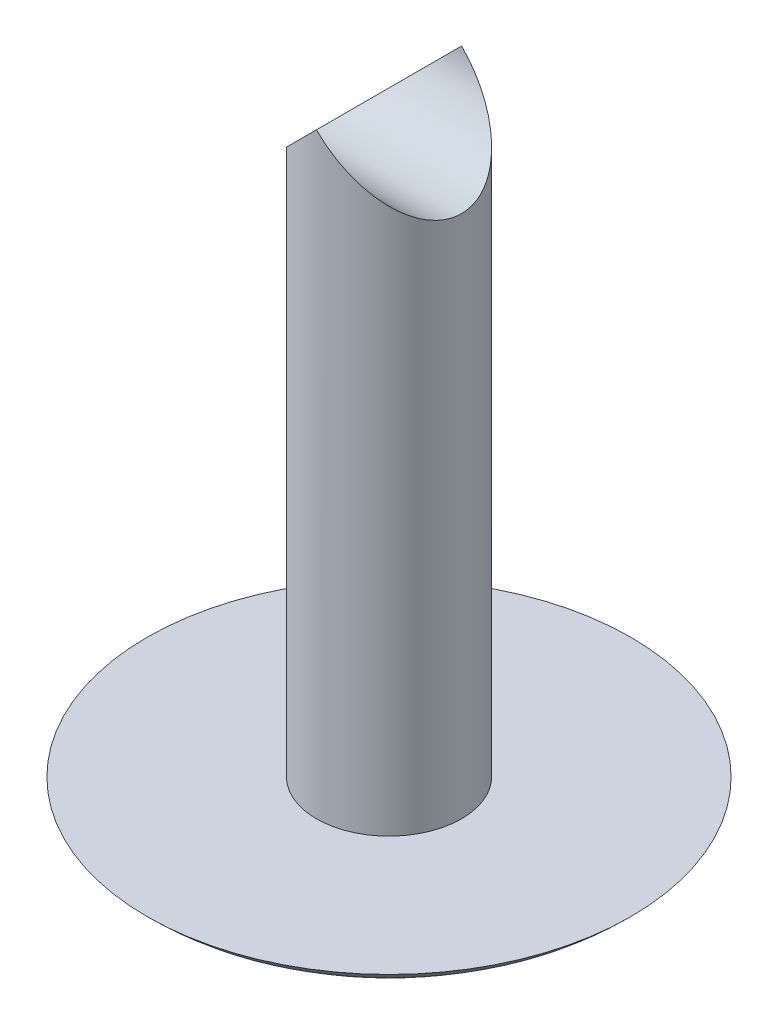
ISO-10303-21;
HEADER;
FILE_DESCRIPTION(('STEP AP214'),'2;1');
FILE_NAME('part.step','',(''),(''),'','','');
FILE_SCHEMA(('AUTOMOTIVE_DESIGN { 1 0 10303 214 1 1 1 1 }'));
ENDSEC;
DATA;
#1=APPLICATION_CONTEXT('core data for automotive mechanical design processes');
#2=APPLICATION_PROTOCOL_DEFINITION('international standard','automotive_design',2000,#1);
#3=PRODUCT_CONTEXT('',#1,'mechanical');
#4=PRODUCT('Part','Part','',(#3));
#5=PRODUCT_RELATED_PRODUCT_CATEGORY('part','',(#4));
#6=PRODUCT_DEFINITION_FORMATION('','',#4);
#7=PRODUCT_DEFINITION_CONTEXT('part definition',#1,'design');
#8=PRODUCT_DEFINITION('design','',#6,#7);
#9=PRODUCT_DEFINITION_SHAPE('','',#8);
#10=(LENGTH_UNIT() NAMED_UNIT(*) SI_UNIT(.MILLI.,.METRE.));
#11=(NAMED_UNIT(*) PLANE_ANGLE_UNIT() SI_UNIT($,.RADIAN.));
#12=(NAMED_UNIT(*) SI_UNIT($,.STERADIAN.) SOLID_ANGLE_UNIT());
#13=UNCERTAINTY_MEASURE_WITH_UNIT(LENGTH_MEASURE(1.E-05),#10,'distance_accuracy_value','');
#14=(GEOMETRIC_REPRESENTATION_CONTEXT(3) GLOBAL_UNCERTAINTY_ASSIGNED_CONTEXT((#13)) GLOBAL_UNIT_ASSIGNED_CONTEXT((#10,
#11,#12)) REPRESENTATION_CONTEXT('',''));
#15=CARTESIAN_POINT('',(0.,0.,0.));
#16=DIRECTION('',(0.,0.,1.));
#17=DIRECTION('',(1.,0.,0.));
#18=AXIS2_PLACEMENT_3D('',#15,#16,#17);
#19=CARTESIAN_POINT('',(0.,-37.,0.));
#20=DIRECTION('',(0.,1.,0.));
#21=DIRECTION('',(-1.,0.,0.));
#22=AXIS2_PLACEMENT_3D('',#19,#20,#21);
#23=CYLINDRICAL_SURFACE('',#22,4.5);
#24=CARTESIAN_POINT('',(0.,-37.,0.));
#25=DIRECTION('',(0.,-1.,0.));
#26=DIRECTION('',(1.,0.,0.));
#27=AXIS2_PLACEMENT_3D('',#24,#25,#26);
#28=CIRCLE('',#27,4.5);
#29=CARTESIAN_POINT('',(4.5,-37.,0.));
#30=VERTEX_POINT('',#29);
#31=EDGE_CURVE('E11',#30,#30,#28,.T.);
#32=ORIENTED_EDGE('',*,*,#31,.F.);
#33=EDGE_LOOP('',(#32));
#34=FACE_BOUND('',#33,.T.);
#35=CARTESIAN_POINT('',(0.,0.,0.));
#36=DIRECTION('',(-0.707106781186548,0.707106781186548,0.));
#37=DIRECTION('',(0.707106781186548,0.707106781186548,0.));
#38=AXIS2_PLACEMENT_3D('',#35,#36,#37);
#39=ELLIPSE('',#38,6.36396103067893,4.5);
#40=CARTESIAN_POINT('',(0.,0.,-4.5));
#41=VERTEX_POINT('',#40);
#42=CARTESIAN_POINT('',(0.,0.,4.5));
#43=VERTEX_POINT('',#42);
#44=EDGE_CURVE('E25',#41,#43,#39,.T.);
#45=ORIENTED_EDGE('',*,*,#44,.F.);
#46=CARTESIAN_POINT('',(0.,0.,0.));
#47=DIRECTION('',(0.707106781186548,0.707106781186548,0.));
#48=DIRECTION('',(-0.707106781186548,0.707106781186548,0.));
#49=AXIS2_PLACEMENT_3D('',#46,#47,#48);
#50=ELLIPSE('',#49,6.36396103067893,4.5);
#51=EDGE_CURVE('E37',#43,#41,#50,.T.);
#52=ORIENTED_EDGE('',*,*,#51,.F.);
#53=EDGE_LOOP('',(#45,#52));
#54=FACE_BOUND('',#53,.T.);
#55=ADVANCED_FACE('F17',(#34,#54),#23,.T.);
#56=CARTESIAN_POINT('',(30.,0.,0.));
#57=DIRECTION('',(-1.,0.,0.));
#58=DIRECTION('',(0.,-1.,0.));
#59=AXIS2_PLACEMENT_3D('',#56,#57,#58);
#60=CYLINDRICAL_SURFACE('',#59,4.5);
#61=ORIENTED_EDGE('',*,*,#44,.T.);
#62=ORIENTED_EDGE('',*,*,#51,.T.);
#63=EDGE_LOOP('',(#61,#62));
#64=FACE_BOUND('',#63,.T.);
#65=ADVANCED_FACE('F42',(#64),#60,.F.);
#66=CARTESIAN_POINT('',(0.,-40.,0.));
#67=DIRECTION('',(0.,-1.,0.));
#68=DIRECTION('',(1.,0.,0.));
#69=AXIS2_PLACEMENT_3D('',#66,#67,#68);
#70=PLANE('',#69);
#71=CARTESIAN_POINT('',(0.,-40.,0.));
#72=DIRECTION('',(0.,-1.,0.));
#73=DIRECTION('',(1.,0.,0.));
#74=AXIS2_PLACEMENT_3D('',#71,#72,#73);
#75=CIRCLE('',#74,7.85857157145715);
#76=CARTESIAN_POINT('',(7.85857157145715,-40.,0.));
#77=VERTEX_POINT('',#76);
#78=EDGE_CURVE('E40',#77,#77,#75,.T.);
#79=ORIENTED_EDGE('',*,*,#78,.T.);
#80=EDGE_LOOP('',(#79));
#81=FACE_BOUND('',#80,.T.);
#82=ADVANCED_FACE('F61',(#81),#70,.T.);
#83=CARTESIAN_POINT('',(0.,-37.,0.));
#84=DIRECTION('',(0.,-1.,0.));
#85=DIRECTION('',(1.,0.,0.));
#86=AXIS2_PLACEMENT_3D('',#83,#84,#85);
#87=PLANE('',#86);
#88=ORIENTED_EDGE('',*,*,#31,.T.);
#89=EDGE_LOOP('',(#88));
#90=FACE_BOUND('',#89,.T.);
#91=CARTESIAN_POINT('',(0.,-37.,0.));
#92=DIRECTION('',(0.,-1.,0.));
#93=DIRECTION('',(1.,0.,0.));
#94=AXIS2_PLACEMENT_3D('',#91,#92,#93);
#95=CIRCLE('',#94,15.);
#96=CARTESIAN_POINT('',(15.,-37.,0.));
#97=VERTEX_POINT('',#96);
#98=EDGE_CURVE('E49',#97,#97,#95,.T.);
#99=ORIENTED_EDGE('',*,*,#98,.F.);
#100=EDGE_LOOP('',(#99));
#101=FACE_BOUND('',#100,.T.);
#102=ADVANCED_FACE('F59',(#90,#101),#87,.F.);
#103=CARTESIAN_POINT('',(0.,-30.,0.));
#104=DIRECTION('',(0.,1.,0.));
#105=DIRECTION('',(-1.,0.,0.));
#106=AXIS2_PLACEMENT_3D('',#103,#104,#105);
#107=DEGENERATE_TOROIDAL_SURFACE('',#106,7.85857157145715,10.,.T.);
#108=ORIENTED_EDGE('',*,*,#98,.T.);
#109=EDGE_LOOP('',(#108));
#110=FACE_BOUND('',#109,.T.);
#111=ORIENTED_EDGE('',*,*,#78,.F.);
#112=EDGE_LOOP('',(#111));
#113=FACE_BOUND('',#112,.T.);
#114=ADVANCED_FACE('F56',(#110,#113),#107,.T.);
#115=CLOSED_SHELL('',(#55,#65,#82,#102,#114));
#116=MANIFOLD_SOLID_BREP('B1',#115);
#117=ADVANCED_BREP_SHAPE_REPRESENTATION('',(#18,#116),#14);
#118=SHAPE_DEFINITION_REPRESENTATION(#9,#117);
ENDSEC;
END-ISO-10303-21;
